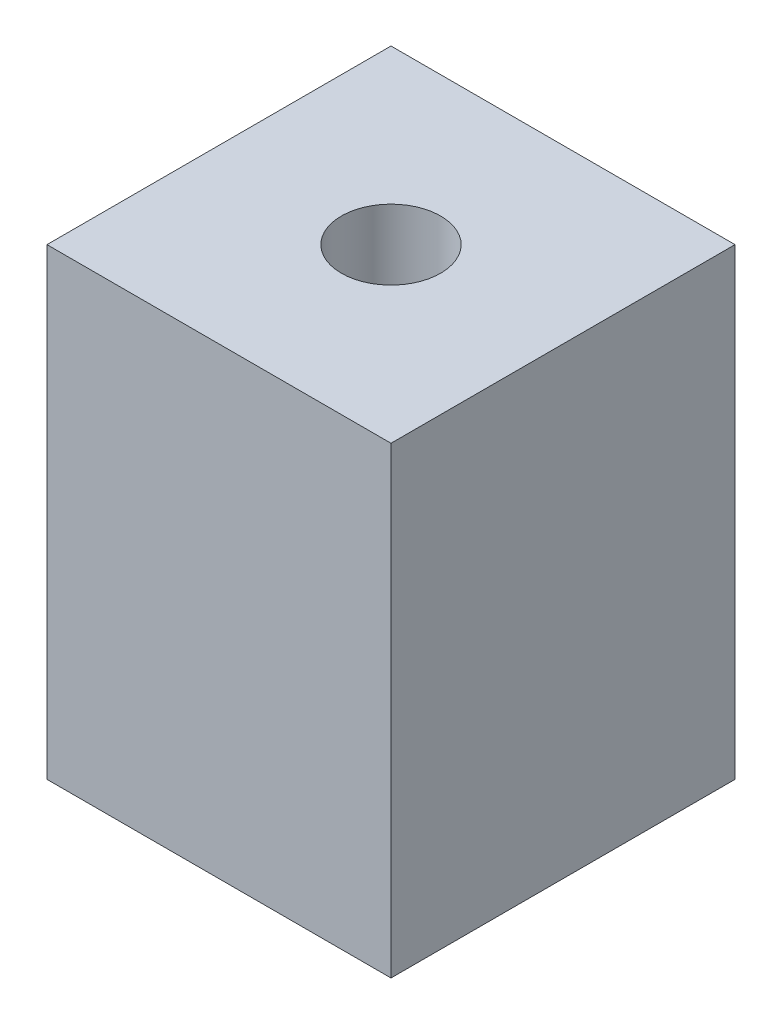
ISO-10303-21;
HEADER;
FILE_DESCRIPTION(('STEP AP214'),'2;1');
FILE_NAME('part.step','',(''),(''),'','','');
FILE_SCHEMA(('AUTOMOTIVE_DESIGN { 1 0 10303 214 1 1 1 1 }'));
ENDSEC;
DATA;
#1=APPLICATION_CONTEXT('core data for automotive mechanical design processes');
#2=APPLICATION_PROTOCOL_DEFINITION('international standard','automotive_design',2000,#1);
#3=PRODUCT_CONTEXT('',#1,'mechanical');
#4=PRODUCT('Part','Part','',(#3));
#5=PRODUCT_RELATED_PRODUCT_CATEGORY('part','',(#4));
#6=PRODUCT_DEFINITION_FORMATION('','',#4);
#7=PRODUCT_DEFINITION_CONTEXT('part definition',#1,'design');
#8=PRODUCT_DEFINITION('design','',#6,#7);
#9=PRODUCT_DEFINITION_SHAPE('','',#8);
#10=(LENGTH_UNIT() NAMED_UNIT(*) SI_UNIT(.MILLI.,.METRE.));
#11=(NAMED_UNIT(*) PLANE_ANGLE_UNIT() SI_UNIT($,.RADIAN.));
#12=(NAMED_UNIT(*) SI_UNIT($,.STERADIAN.) SOLID_ANGLE_UNIT());
#13=UNCERTAINTY_MEASURE_WITH_UNIT(LENGTH_MEASURE(1.E-05),#10,'distance_accuracy_value','');
#14=(GEOMETRIC_REPRESENTATION_CONTEXT(3) GLOBAL_UNCERTAINTY_ASSIGNED_CONTEXT((#13)) GLOBAL_UNIT_ASSIGNED_CONTEXT((#10,
#11,#12)) REPRESENTATION_CONTEXT('',''));
#15=CARTESIAN_POINT('',(0.,0.,0.));
#16=DIRECTION('',(0.,0.,1.));
#17=DIRECTION('',(1.,0.,0.));
#18=AXIS2_PLACEMENT_3D('',#15,#16,#17);
#19=CARTESIAN_POINT('',(1.3,3.5,-1.3));
#20=DIRECTION('',(-1.,0.,0.));
#21=DIRECTION('',(0.,0.,1.));
#22=AXIS2_PLACEMENT_3D('',#19,#20,#21);
#23=PLANE('',#22);
#24=DIRECTION('',(0.,0.,-1.));
#25=VECTOR('',#24,1.);
#26=CARTESIAN_POINT('',(1.3,0.,-1.3));
#27=LINE('',#26,#25);
#28=CARTESIAN_POINT('',(1.3,0.,1.3));
#29=VERTEX_POINT('',#28);
#30=CARTESIAN_POINT('',(1.3,0.,-1.3));
#31=VERTEX_POINT('',#30);
#32=EDGE_CURVE('E108',#29,#31,#27,.T.);
#33=ORIENTED_EDGE('',*,*,#32,.T.);
#34=DIRECTION('',(0.,-1.,0.));
#35=VECTOR('',#34,1.);
#36=CARTESIAN_POINT('',(1.3,3.5,-1.3));
#37=LINE('',#36,#35);
#38=CARTESIAN_POINT('',(1.3,3.5,-1.3));
#39=VERTEX_POINT('',#38);
#40=EDGE_CURVE('E11',#39,#31,#37,.T.);
#41=ORIENTED_EDGE('',*,*,#40,.F.);
#42=DIRECTION('',(0.,0.,-1.));
#43=VECTOR('',#42,1.);
#44=CARTESIAN_POINT('',(1.3,3.5,-1.3));
#45=LINE('',#44,#43);
#46=CARTESIAN_POINT('',(1.3,3.5,1.3));
#47=VERTEX_POINT('',#46);
#48=EDGE_CURVE('E119',#47,#39,#45,.T.);
#49=ORIENTED_EDGE('',*,*,#48,.F.);
#50=DIRECTION('',(0.,-1.,0.));
#51=VECTOR('',#50,1.);
#52=CARTESIAN_POINT('',(1.3,3.5,1.3));
#53=LINE('',#52,#51);
#54=EDGE_CURVE('E128',#47,#29,#53,.T.);
#55=ORIENTED_EDGE('',*,*,#54,.T.);
#56=EDGE_LOOP('',(#33,#41,#49,#55));
#57=FACE_BOUND('',#56,.T.);
#58=ADVANCED_FACE('F45',(#57),#23,.F.);
#59=CARTESIAN_POINT('',(-1.3,3.5,-1.3));
#60=DIRECTION('',(0.,0.,1.));
#61=DIRECTION('',(1.,0.,0.));
#62=AXIS2_PLACEMENT_3D('',#59,#60,#61);
#63=PLANE('',#62);
#64=DIRECTION('',(-1.,0.,0.));
#65=VECTOR('',#64,1.);
#66=CARTESIAN_POINT('',(-1.3,0.,-1.3));
#67=LINE('',#66,#65);
#68=CARTESIAN_POINT('',(-1.3,0.,-1.3));
#69=VERTEX_POINT('',#68);
#70=EDGE_CURVE('E114',#31,#69,#67,.T.);
#71=ORIENTED_EDGE('',*,*,#70,.T.);
#72=DIRECTION('',(0.,-1.,0.));
#73=VECTOR('',#72,1.);
#74=CARTESIAN_POINT('',(-1.3,3.5,-1.3));
#75=LINE('',#74,#73);
#76=CARTESIAN_POINT('',(-1.3,3.5,-1.3));
#77=VERTEX_POINT('',#76);
#78=EDGE_CURVE('E54',#77,#69,#75,.T.);
#79=ORIENTED_EDGE('',*,*,#78,.F.);
#80=DIRECTION('',(-1.,0.,0.));
#81=VECTOR('',#80,1.);
#82=CARTESIAN_POINT('',(-1.3,3.5,-1.3));
#83=LINE('',#82,#81);
#84=EDGE_CURVE('E93',#39,#77,#83,.T.);
#85=ORIENTED_EDGE('',*,*,#84,.F.);
#86=ORIENTED_EDGE('',*,*,#40,.T.);
#87=EDGE_LOOP('',(#71,#79,#85,#86));
#88=FACE_BOUND('',#87,.T.);
#89=ADVANCED_FACE('F158',(#88),#63,.F.);
#90=CARTESIAN_POINT('',(-1.3,3.5,-1.3));
#91=DIRECTION('',(1.,0.,0.));
#92=DIRECTION('',(0.,0.,-1.));
#93=AXIS2_PLACEMENT_3D('',#90,#91,#92);
#94=PLANE('',#93);
#95=DIRECTION('',(0.,0.,1.));
#96=VECTOR('',#95,1.);
#97=CARTESIAN_POINT('',(-1.3,0.,-1.3));
#98=LINE('',#97,#96);
#99=CARTESIAN_POINT('',(-1.3,0.,1.3));
#100=VERTEX_POINT('',#99);
#101=EDGE_CURVE('E80',#69,#100,#98,.T.);
#102=ORIENTED_EDGE('',*,*,#101,.T.);
#103=DIRECTION('',(0.,-1.,0.));
#104=VECTOR('',#103,1.);
#105=CARTESIAN_POINT('',(-1.3,3.5,1.3));
#106=LINE('',#105,#104);
#107=CARTESIAN_POINT('',(-1.3,3.5,1.3));
#108=VERTEX_POINT('',#107);
#109=EDGE_CURVE('E138',#108,#100,#106,.T.);
#110=ORIENTED_EDGE('',*,*,#109,.F.);
#111=DIRECTION('',(0.,0.,1.));
#112=VECTOR('',#111,1.);
#113=CARTESIAN_POINT('',(-1.3,3.5,-1.3));
#114=LINE('',#113,#112);
#115=EDGE_CURVE('E124',#77,#108,#114,.T.);
#116=ORIENTED_EDGE('',*,*,#115,.F.);
#117=ORIENTED_EDGE('',*,*,#78,.T.);
#118=EDGE_LOOP('',(#102,#110,#116,#117));
#119=FACE_BOUND('',#118,.T.);
#120=ADVANCED_FACE('F142',(#119),#94,.F.);
#121=CARTESIAN_POINT('',(-1.3,3.5,1.3));
#122=DIRECTION('',(0.,0.,-1.));
#123=DIRECTION('',(-1.,0.,0.));
#124=AXIS2_PLACEMENT_3D('',#121,#122,#123);
#125=PLANE('',#124);
#126=DIRECTION('',(1.,0.,0.));
#127=VECTOR('',#126,1.);
#128=CARTESIAN_POINT('',(-1.3,0.,1.3));
#129=LINE('',#128,#127);
#130=EDGE_CURVE('E86',#100,#29,#129,.T.);
#131=ORIENTED_EDGE('',*,*,#130,.T.);
#132=ORIENTED_EDGE('',*,*,#54,.F.);
#133=DIRECTION('',(1.,0.,0.));
#134=VECTOR('',#133,1.);
#135=CARTESIAN_POINT('',(-1.3,3.5,1.3));
#136=LINE('',#135,#134);
#137=EDGE_CURVE('E62',#108,#47,#136,.T.);
#138=ORIENTED_EDGE('',*,*,#137,.F.);
#139=ORIENTED_EDGE('',*,*,#109,.T.);
#140=EDGE_LOOP('',(#131,#132,#138,#139));
#141=FACE_BOUND('',#140,.T.);
#142=ADVANCED_FACE('F148',(#141),#125,.F.);
#143=CARTESIAN_POINT('',(0.,3.5,0.));
#144=DIRECTION('',(0.,1.,0.));
#145=DIRECTION('',(0.,0.,1.));
#146=AXIS2_PLACEMENT_3D('',#143,#144,#145);
#147=PLANE('',#146);
#148=CARTESIAN_POINT('',(0.,3.5,0.));
#149=DIRECTION('',(0.,1.,0.));
#150=DIRECTION('',(0.,0.,1.));
#151=AXIS2_PLACEMENT_3D('',#148,#149,#150);
#152=CIRCLE('',#151,0.375);
#153=CARTESIAN_POINT('',(0.,3.5,0.375));
#154=VERTEX_POINT('',#153);
#155=EDGE_CURVE('E109',#154,#154,#152,.T.);
#156=ORIENTED_EDGE('',*,*,#155,.F.);
#157=EDGE_LOOP('',(#156));
#158=FACE_BOUND('',#157,.T.);
#159=ORIENTED_EDGE('',*,*,#48,.T.);
#160=ORIENTED_EDGE('',*,*,#84,.T.);
#161=ORIENTED_EDGE('',*,*,#115,.T.);
#162=ORIENTED_EDGE('',*,*,#137,.T.);
#163=EDGE_LOOP('',(#159,#160,#161,#162));
#164=FACE_BOUND('',#163,.T.);
#165=ADVANCED_FACE('F150',(#158,#164),#147,.T.);
#166=CARTESIAN_POINT('',(0.,0.,0.));
#167=DIRECTION('',(0.,1.,0.));
#168=DIRECTION('',(0.,0.,1.));
#169=AXIS2_PLACEMENT_3D('',#166,#167,#168);
#170=PLANE('',#169);
#171=ORIENTED_EDGE('',*,*,#32,.F.);
#172=ORIENTED_EDGE('',*,*,#130,.F.);
#173=ORIENTED_EDGE('',*,*,#101,.F.);
#174=ORIENTED_EDGE('',*,*,#70,.F.);
#175=EDGE_LOOP('',(#171,#172,#173,#174));
#176=FACE_BOUND('',#175,.T.);
#177=ADVANCED_FACE('F101',(#176),#170,.F.);
#178=CARTESIAN_POINT('',(0.,1.,0.));
#179=DIRECTION('',(0.,1.,0.));
#180=DIRECTION('',(0.,0.,1.));
#181=AXIS2_PLACEMENT_3D('',#178,#179,#180);
#182=CONICAL_SURFACE('',#181,0.374999999999999,1.02974425867665);
#183=CARTESIAN_POINT('',(0.,0.774677267864665,0.));
#184=VERTEX_POINT('',#183);
#185=VERTEX_LOOP('',#184);
#186=FACE_BOUND('',#185,.T.);
#187=CARTESIAN_POINT('',(0.,1.,0.));
#188=DIRECTION('',(0.,1.,0.));
#189=DIRECTION('',(0.,0.,1.));
#190=AXIS2_PLACEMENT_3D('',#187,#188,#189);
#191=CIRCLE('',#190,0.374999999999999);
#192=CARTESIAN_POINT('',(0.,1.,0.374999999999999));
#193=VERTEX_POINT('',#192);
#194=EDGE_CURVE('E105',#193,#193,#191,.T.);
#195=ORIENTED_EDGE('',*,*,#194,.T.);
#196=EDGE_LOOP('',(#195));
#197=FACE_BOUND('',#196,.T.);
#198=ADVANCED_FACE('F97',(#186,#197),#182,.F.);
#199=CARTESIAN_POINT('',(0.,3.5,0.));
#200=DIRECTION('',(0.,1.,0.));
#201=DIRECTION('',(0.,0.,1.));
#202=AXIS2_PLACEMENT_3D('',#199,#200,#201);
#203=CYLINDRICAL_SURFACE('',#202,0.374999999999999);
#204=ORIENTED_EDGE('',*,*,#194,.F.);
#205=EDGE_LOOP('',(#204));
#206=FACE_BOUND('',#205,.T.);
#207=ORIENTED_EDGE('',*,*,#155,.T.);
#208=EDGE_LOOP('',(#207));
#209=FACE_BOUND('',#208,.T.);
#210=ADVANCED_FACE('F100',(#206,#209),#203,.F.);
#211=CLOSED_SHELL('',(#58,#89,#120,#142,#165,#177,#198,#210));
#212=MANIFOLD_SOLID_BREP('B2',#211);
#213=ADVANCED_BREP_SHAPE_REPRESENTATION('',(#18,#212),#14);
#214=SHAPE_DEFINITION_REPRESENTATION(#9,#213);
ENDSEC;
END-ISO-10303-21;
